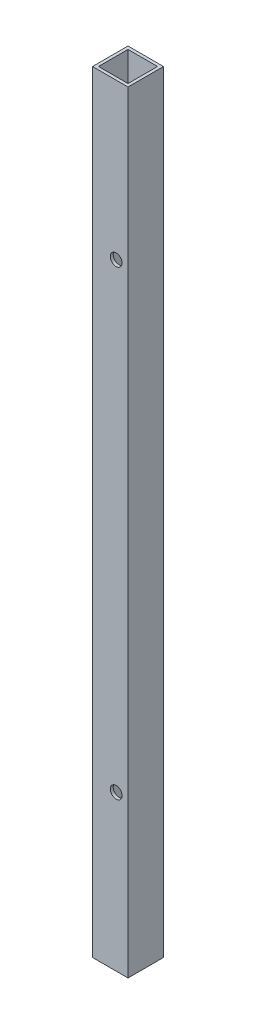
ISO-10303-21;
HEADER;
FILE_DESCRIPTION(('STEP AP214'),'2;1');
FILE_NAME('part.step','',(''),(''),'','','');
FILE_SCHEMA(('AUTOMOTIVE_DESIGN { 1 0 10303 214 1 1 1 1 }'));
ENDSEC;
DATA;
#1=APPLICATION_CONTEXT('core data for automotive mechanical design processes');
#2=APPLICATION_PROTOCOL_DEFINITION('international standard','automotive_design',2000,#1);
#3=PRODUCT_CONTEXT('',#1,'mechanical');
#4=PRODUCT('Part','Part','',(#3));
#5=PRODUCT_RELATED_PRODUCT_CATEGORY('part','',(#4));
#6=PRODUCT_DEFINITION_FORMATION('','',#4);
#7=PRODUCT_DEFINITION_CONTEXT('part definition',#1,'design');
#8=PRODUCT_DEFINITION('design','',#6,#7);
#9=PRODUCT_DEFINITION_SHAPE('','',#8);
#10=(LENGTH_UNIT() NAMED_UNIT(*) SI_UNIT(.MILLI.,.METRE.));
#11=(NAMED_UNIT(*) PLANE_ANGLE_UNIT() SI_UNIT($,.RADIAN.));
#12=(NAMED_UNIT(*) SI_UNIT($,.STERADIAN.) SOLID_ANGLE_UNIT());
#13=UNCERTAINTY_MEASURE_WITH_UNIT(LENGTH_MEASURE(1.E-05),#10,'distance_accuracy_value','');
#14=(GEOMETRIC_REPRESENTATION_CONTEXT(3) GLOBAL_UNCERTAINTY_ASSIGNED_CONTEXT((#13)) GLOBAL_UNIT_ASSIGNED_CONTEXT((#10,
#11,#12)) REPRESENTATION_CONTEXT('',''));
#15=CARTESIAN_POINT('',(0.,0.,0.));
#16=DIRECTION('',(0.,0.,1.));
#17=DIRECTION('',(1.,0.,0.));
#18=AXIS2_PLACEMENT_3D('',#15,#16,#17);
#19=CARTESIAN_POINT('',(0.,414.3375,0.));
#20=DIRECTION('',(0.,-1.,0.));
#21=DIRECTION('',(0.,0.,-1.));
#22=AXIS2_PLACEMENT_3D('',#19,#20,#21);
#23=PLANE('',#22);
#24=DIRECTION('',(0.,0.,1.));
#25=VECTOR('',#24,1.);
#26=CARTESIAN_POINT('',(0.,414.3375,0.));
#27=LINE('',#26,#25);
#28=CARTESIAN_POINT('',(0.,414.3375,-19.05));
#29=VERTEX_POINT('',#28);
#30=CARTESIAN_POINT('',(0.,414.3375,0.));
#31=VERTEX_POINT('',#30);
#32=EDGE_CURVE('E161',#29,#31,#27,.T.);
#33=ORIENTED_EDGE('',*,*,#32,.T.);
#34=DIRECTION('',(1.,0.,0.));
#35=VECTOR('',#34,1.);
#36=CARTESIAN_POINT('',(0.,414.3375,0.));
#37=LINE('',#36,#35);
#38=CARTESIAN_POINT('',(19.05,414.3375,0.));
#39=VERTEX_POINT('',#38);
#40=EDGE_CURVE('E164',#31,#39,#37,.T.);
#41=ORIENTED_EDGE('',*,*,#40,.T.);
#42=DIRECTION('',(0.,0.,-1.));
#43=VECTOR('',#42,1.);
#44=CARTESIAN_POINT('',(19.05,414.3375,0.));
#45=LINE('',#44,#43);
#46=CARTESIAN_POINT('',(19.05,414.3375,-19.05));
#47=VERTEX_POINT('',#46);
#48=EDGE_CURVE('E167',#39,#47,#45,.T.);
#49=ORIENTED_EDGE('',*,*,#48,.T.);
#50=DIRECTION('',(-1.,0.,0.));
#51=VECTOR('',#50,1.);
#52=CARTESIAN_POINT('',(0.,414.3375,-19.05));
#53=LINE('',#52,#51);
#54=EDGE_CURVE('E169',#47,#29,#53,.T.);
#55=ORIENTED_EDGE('',*,*,#54,.T.);
#56=EDGE_LOOP('',(#33,#41,#49,#55));
#57=FACE_BOUND('',#56,.T.);
#58=DIRECTION('',(0.,0.,1.));
#59=VECTOR('',#58,1.);
#60=CARTESIAN_POINT('',(1.5875,414.3375,-1.5875));
#61=LINE('',#60,#59);
#62=CARTESIAN_POINT('',(1.5875,414.3375,-17.4625));
#63=VERTEX_POINT('',#62);
#64=CARTESIAN_POINT('',(1.5875,414.3375,-1.5875));
#65=VERTEX_POINT('',#64);
#66=EDGE_CURVE('E115',#63,#65,#61,.T.);
#67=ORIENTED_EDGE('',*,*,#66,.F.);
#68=DIRECTION('',(-1.,0.,0.));
#69=VECTOR('',#68,1.);
#70=CARTESIAN_POINT('',(1.5875,414.3375,-17.4625));
#71=LINE('',#70,#69);
#72=CARTESIAN_POINT('',(17.4625,414.3375,-17.4625));
#73=VERTEX_POINT('',#72);
#74=EDGE_CURVE('E138',#73,#63,#71,.T.);
#75=ORIENTED_EDGE('',*,*,#74,.F.);
#76=DIRECTION('',(0.,0.,-1.));
#77=VECTOR('',#76,1.);
#78=CARTESIAN_POINT('',(17.4625,414.3375,-1.5875));
#79=LINE('',#78,#77);
#80=CARTESIAN_POINT('',(17.4625,414.3375,-1.5875));
#81=VERTEX_POINT('',#80);
#82=EDGE_CURVE('E136',#81,#73,#79,.T.);
#83=ORIENTED_EDGE('',*,*,#82,.F.);
#84=DIRECTION('',(1.,0.,0.));
#85=VECTOR('',#84,1.);
#86=CARTESIAN_POINT('',(1.5875,414.3375,-1.5875));
#87=LINE('',#86,#85);
#88=EDGE_CURVE('E123',#65,#81,#87,.T.);
#89=ORIENTED_EDGE('',*,*,#88,.F.);
#90=EDGE_LOOP('',(#67,#75,#83,#89));
#91=FACE_BOUND('',#90,.T.);
#92=ADVANCED_FACE('F39',(#57,#91),#23,.F.);
#93=CARTESIAN_POINT('',(0.,0.,0.));
#94=DIRECTION('',(0.,-1.,0.));
#95=DIRECTION('',(0.,0.,-1.));
#96=AXIS2_PLACEMENT_3D('',#93,#94,#95);
#97=PLANE('',#96);
#98=DIRECTION('',(0.,0.,1.));
#99=VECTOR('',#98,1.);
#100=CARTESIAN_POINT('',(0.,0.,0.));
#101=LINE('',#100,#99);
#102=CARTESIAN_POINT('',(0.,0.,-19.05));
#103=VERTEX_POINT('',#102);
#104=CARTESIAN_POINT('',(0.,0.,0.));
#105=VERTEX_POINT('',#104);
#106=EDGE_CURVE('E132',#103,#105,#101,.T.);
#107=ORIENTED_EDGE('',*,*,#106,.F.);
#108=DIRECTION('',(-1.,0.,0.));
#109=VECTOR('',#108,1.);
#110=CARTESIAN_POINT('',(0.,0.,-19.05));
#111=LINE('',#110,#109);
#112=CARTESIAN_POINT('',(19.05,0.,-19.05));
#113=VERTEX_POINT('',#112);
#114=EDGE_CURVE('E165',#113,#103,#111,.T.);
#115=ORIENTED_EDGE('',*,*,#114,.F.);
#116=DIRECTION('',(0.,0.,-1.));
#117=VECTOR('',#116,1.);
#118=CARTESIAN_POINT('',(19.05,0.,0.));
#119=LINE('',#118,#117);
#120=CARTESIAN_POINT('',(19.05,0.,0.));
#121=VERTEX_POINT('',#120);
#122=EDGE_CURVE('E178',#121,#113,#119,.T.);
#123=ORIENTED_EDGE('',*,*,#122,.F.);
#124=DIRECTION('',(1.,0.,0.));
#125=VECTOR('',#124,1.);
#126=CARTESIAN_POINT('',(0.,0.,0.));
#127=LINE('',#126,#125);
#128=EDGE_CURVE('E175',#105,#121,#127,.T.);
#129=ORIENTED_EDGE('',*,*,#128,.F.);
#130=EDGE_LOOP('',(#107,#115,#123,#129));
#131=FACE_BOUND('',#130,.T.);
#132=DIRECTION('',(-1.,0.,0.));
#133=VECTOR('',#132,1.);
#134=CARTESIAN_POINT('',(1.5875,0.,-17.4625));
#135=LINE('',#134,#133);
#136=CARTESIAN_POINT('',(17.4625,0.,-17.4625));
#137=VERTEX_POINT('',#136);
#138=CARTESIAN_POINT('',(1.5875,0.,-17.4625));
#139=VERTEX_POINT('',#138);
#140=EDGE_CURVE('E124',#137,#139,#135,.T.);
#141=ORIENTED_EDGE('',*,*,#140,.T.);
#142=DIRECTION('',(0.,0.,1.));
#143=VECTOR('',#142,1.);
#144=CARTESIAN_POINT('',(1.5875,0.,-1.5875));
#145=LINE('',#144,#143);
#146=CARTESIAN_POINT('',(1.5875,0.,-1.5875));
#147=VERTEX_POINT('',#146);
#148=EDGE_CURVE('E68',#139,#147,#145,.T.);
#149=ORIENTED_EDGE('',*,*,#148,.T.);
#150=DIRECTION('',(1.,0.,0.));
#151=VECTOR('',#150,1.);
#152=CARTESIAN_POINT('',(1.5875,0.,-1.5875));
#153=LINE('',#152,#151);
#154=CARTESIAN_POINT('',(17.4625,0.,-1.5875));
#155=VERTEX_POINT('',#154);
#156=EDGE_CURVE('E130',#147,#155,#153,.T.);
#157=ORIENTED_EDGE('',*,*,#156,.T.);
#158=DIRECTION('',(0.,0.,-1.));
#159=VECTOR('',#158,1.);
#160=CARTESIAN_POINT('',(17.4625,0.,-1.5875));
#161=LINE('',#160,#159);
#162=EDGE_CURVE('E148',#155,#137,#161,.T.);
#163=ORIENTED_EDGE('',*,*,#162,.T.);
#164=EDGE_LOOP('',(#141,#149,#157,#163));
#165=FACE_BOUND('',#164,.T.);
#166=ADVANCED_FACE('F238',(#131,#165),#97,.T.);
#167=CARTESIAN_POINT('',(0.,414.3375,0.));
#168=DIRECTION('',(1.,0.,0.));
#169=DIRECTION('',(0.,0.,-1.));
#170=AXIS2_PLACEMENT_3D('',#167,#168,#169);
#171=PLANE('',#170);
#172=ORIENTED_EDGE('',*,*,#106,.T.);
#173=DIRECTION('',(0.,-1.,0.));
#174=VECTOR('',#173,1.);
#175=CARTESIAN_POINT('',(0.,414.3375,0.));
#176=LINE('',#175,#174);
#177=EDGE_CURVE('E11',#31,#105,#176,.T.);
#178=ORIENTED_EDGE('',*,*,#177,.F.);
#179=ORIENTED_EDGE('',*,*,#32,.F.);
#180=DIRECTION('',(0.,-1.,0.));
#181=VECTOR('',#180,1.);
#182=CARTESIAN_POINT('',(0.,414.3375,-19.05));
#183=LINE('',#182,#181);
#184=EDGE_CURVE('E171',#29,#103,#183,.T.);
#185=ORIENTED_EDGE('',*,*,#184,.T.);
#186=EDGE_LOOP('',(#172,#178,#179,#185));
#187=FACE_BOUND('',#186,.T.);
#188=ADVANCED_FACE('F41',(#187),#171,.F.);
#189=CARTESIAN_POINT('',(0.,414.3375,0.));
#190=DIRECTION('',(0.,0.,-1.));
#191=DIRECTION('',(-1.,0.,0.));
#192=AXIS2_PLACEMENT_3D('',#189,#190,#191);
#193=PLANE('',#192);
#194=CARTESIAN_POINT('',(12.7000000000001,330.82992,0.));
#195=DIRECTION('',(0.,0.,1.));
#196=DIRECTION('',(1.,0.,0.));
#197=AXIS2_PLACEMENT_3D('',#194,#195,#196);
#198=CIRCLE('',#197,3.175);
#199=CARTESIAN_POINT('',(15.8750000000001,330.82992,0.));
#200=VERTEX_POINT('',#199);
#201=EDGE_CURVE('E214',#200,#200,#198,.T.);
#202=ORIENTED_EDGE('',*,*,#201,.F.);
#203=EDGE_LOOP('',(#202));
#204=FACE_BOUND('',#203,.T.);
#205=CARTESIAN_POINT('',(12.7000000000001,83.17992,0.));
#206=DIRECTION('',(0.,0.,1.));
#207=DIRECTION('',(1.,0.,0.));
#208=AXIS2_PLACEMENT_3D('',#205,#206,#207);
#209=CIRCLE('',#208,3.175);
#210=CARTESIAN_POINT('',(15.8750000000001,83.17992,0.));
#211=VERTEX_POINT('',#210);
#212=EDGE_CURVE('E202',#211,#211,#209,.T.);
#213=ORIENTED_EDGE('',*,*,#212,.F.);
#214=EDGE_LOOP('',(#213));
#215=FACE_BOUND('',#214,.T.);
#216=ORIENTED_EDGE('',*,*,#128,.T.);
#217=DIRECTION('',(0.,-1.,0.));
#218=VECTOR('',#217,1.);
#219=CARTESIAN_POINT('',(19.05,414.3375,0.));
#220=LINE('',#219,#218);
#221=EDGE_CURVE('E49',#39,#121,#220,.T.);
#222=ORIENTED_EDGE('',*,*,#221,.F.);
#223=ORIENTED_EDGE('',*,*,#40,.F.);
#224=ORIENTED_EDGE('',*,*,#177,.T.);
#225=EDGE_LOOP('',(#216,#222,#223,#224));
#226=FACE_BOUND('',#225,.T.);
#227=ADVANCED_FACE('F264',(#204,#215,#226),#193,.F.);
#228=CARTESIAN_POINT('',(19.05,414.3375,0.));
#229=DIRECTION('',(-1.,0.,0.));
#230=DIRECTION('',(0.,0.,1.));
#231=AXIS2_PLACEMENT_3D('',#228,#229,#230);
#232=PLANE('',#231);
#233=ORIENTED_EDGE('',*,*,#122,.T.);
#234=DIRECTION('',(0.,-1.,0.));
#235=VECTOR('',#234,1.);
#236=CARTESIAN_POINT('',(19.05,414.3375,-19.05));
#237=LINE('',#236,#235);
#238=EDGE_CURVE('E186',#47,#113,#237,.T.);
#239=ORIENTED_EDGE('',*,*,#238,.F.);
#240=ORIENTED_EDGE('',*,*,#48,.F.);
#241=ORIENTED_EDGE('',*,*,#221,.T.);
#242=EDGE_LOOP('',(#233,#239,#240,#241));
#243=FACE_BOUND('',#242,.T.);
#244=ADVANCED_FACE('F262',(#243),#232,.F.);
#245=CARTESIAN_POINT('',(0.,414.3375,-19.05));
#246=DIRECTION('',(0.,0.,1.));
#247=DIRECTION('',(1.,0.,0.));
#248=AXIS2_PLACEMENT_3D('',#245,#246,#247);
#249=PLANE('',#248);
#250=CARTESIAN_POINT('',(12.7000000000001,330.82992,-19.05));
#251=DIRECTION('',(0.,0.,1.));
#252=DIRECTION('',(1.,0.,0.));
#253=AXIS2_PLACEMENT_3D('',#250,#251,#252);
#254=CIRCLE('',#253,3.175);
#255=CARTESIAN_POINT('',(15.8750000000001,330.82992,-19.05));
#256=VERTEX_POINT('',#255);
#257=EDGE_CURVE('E218',#256,#256,#254,.T.);
#258=ORIENTED_EDGE('',*,*,#257,.T.);
#259=EDGE_LOOP('',(#258));
#260=FACE_BOUND('',#259,.T.);
#261=CARTESIAN_POINT('',(12.7000000000001,83.17992,-19.05));
#262=DIRECTION('',(0.,0.,1.));
#263=DIRECTION('',(1.,0.,0.));
#264=AXIS2_PLACEMENT_3D('',#261,#262,#263);
#265=CIRCLE('',#264,3.175);
#266=CARTESIAN_POINT('',(15.8750000000001,83.17992,-19.05));
#267=VERTEX_POINT('',#266);
#268=EDGE_CURVE('E195',#267,#267,#265,.T.);
#269=ORIENTED_EDGE('',*,*,#268,.T.);
#270=EDGE_LOOP('',(#269));
#271=FACE_BOUND('',#270,.T.);
#272=ORIENTED_EDGE('',*,*,#114,.T.);
#273=ORIENTED_EDGE('',*,*,#184,.F.);
#274=ORIENTED_EDGE('',*,*,#54,.F.);
#275=ORIENTED_EDGE('',*,*,#238,.T.);
#276=EDGE_LOOP('',(#272,#273,#274,#275));
#277=FACE_BOUND('',#276,.T.);
#278=ADVANCED_FACE('F259',(#260,#271,#277),#249,.F.);
#279=CARTESIAN_POINT('',(1.5875,414.3375,-1.5875));
#280=DIRECTION('',(1.,0.,0.));
#281=DIRECTION('',(0.,0.,-1.));
#282=AXIS2_PLACEMENT_3D('',#279,#280,#281);
#283=PLANE('',#282);
#284=ORIENTED_EDGE('',*,*,#148,.F.);
#285=DIRECTION('',(0.,-1.,0.));
#286=VECTOR('',#285,1.);
#287=CARTESIAN_POINT('',(1.5875,414.3375,-17.4625));
#288=LINE('',#287,#286);
#289=EDGE_CURVE('E119',#63,#139,#288,.T.);
#290=ORIENTED_EDGE('',*,*,#289,.F.);
#291=ORIENTED_EDGE('',*,*,#66,.T.);
#292=DIRECTION('',(0.,-1.,0.));
#293=VECTOR('',#292,1.);
#294=CARTESIAN_POINT('',(1.5875,414.3375,-1.5875));
#295=LINE('',#294,#293);
#296=EDGE_CURVE('E118',#65,#147,#295,.T.);
#297=ORIENTED_EDGE('',*,*,#296,.T.);
#298=EDGE_LOOP('',(#284,#290,#291,#297));
#299=FACE_BOUND('',#298,.T.);
#300=ADVANCED_FACE('F117',(#299),#283,.T.);
#301=CARTESIAN_POINT('',(1.5875,414.3375,-1.5875));
#302=DIRECTION('',(0.,0.,-1.));
#303=DIRECTION('',(-1.,0.,0.));
#304=AXIS2_PLACEMENT_3D('',#301,#302,#303);
#305=PLANE('',#304);
#306=CARTESIAN_POINT('',(12.7000000000001,330.82992,-1.5875));
#307=DIRECTION('',(0.,0.,-1.));
#308=DIRECTION('',(-1.,0.,0.));
#309=AXIS2_PLACEMENT_3D('',#306,#307,#308);
#310=CIRCLE('',#309,3.175);
#311=CARTESIAN_POINT('',(9.52500000000006,330.82992,-1.5875));
#312=VERTEX_POINT('',#311);
#313=EDGE_CURVE('E208',#312,#312,#310,.T.);
#314=ORIENTED_EDGE('',*,*,#313,.F.);
#315=EDGE_LOOP('',(#314));
#316=FACE_BOUND('',#315,.T.);
#317=CARTESIAN_POINT('',(12.7000000000001,83.17992,-1.5875));
#318=DIRECTION('',(0.,0.,-1.));
#319=DIRECTION('',(-1.,0.,0.));
#320=AXIS2_PLACEMENT_3D('',#317,#318,#319);
#321=CIRCLE('',#320,3.175);
#322=CARTESIAN_POINT('',(9.52500000000006,83.17992,-1.5875));
#323=VERTEX_POINT('',#322);
#324=EDGE_CURVE('E145',#323,#323,#321,.T.);
#325=ORIENTED_EDGE('',*,*,#324,.F.);
#326=EDGE_LOOP('',(#325));
#327=FACE_BOUND('',#326,.T.);
#328=ORIENTED_EDGE('',*,*,#156,.F.);
#329=ORIENTED_EDGE('',*,*,#296,.F.);
#330=ORIENTED_EDGE('',*,*,#88,.T.);
#331=DIRECTION('',(0.,-1.,0.));
#332=VECTOR('',#331,1.);
#333=CARTESIAN_POINT('',(17.4625,414.3375,-1.5875));
#334=LINE('',#333,#332);
#335=EDGE_CURVE('E133',#81,#155,#334,.T.);
#336=ORIENTED_EDGE('',*,*,#335,.T.);
#337=EDGE_LOOP('',(#328,#329,#330,#336));
#338=FACE_BOUND('',#337,.T.);
#339=ADVANCED_FACE('F127',(#316,#327,#338),#305,.T.);
#340=CARTESIAN_POINT('',(17.4625,414.3375,-1.5875));
#341=DIRECTION('',(-1.,0.,0.));
#342=DIRECTION('',(0.,0.,1.));
#343=AXIS2_PLACEMENT_3D('',#340,#341,#342);
#344=PLANE('',#343);
#345=ORIENTED_EDGE('',*,*,#162,.F.);
#346=ORIENTED_EDGE('',*,*,#335,.F.);
#347=ORIENTED_EDGE('',*,*,#82,.T.);
#348=DIRECTION('',(0.,-1.,0.));
#349=VECTOR('',#348,1.);
#350=CARTESIAN_POINT('',(17.4625,414.3375,-17.4625));
#351=LINE('',#350,#349);
#352=EDGE_CURVE('E57',#73,#137,#351,.T.);
#353=ORIENTED_EDGE('',*,*,#352,.T.);
#354=EDGE_LOOP('',(#345,#346,#347,#353));
#355=FACE_BOUND('',#354,.T.);
#356=ADVANCED_FACE('F234',(#355),#344,.T.);
#357=CARTESIAN_POINT('',(1.5875,414.3375,-17.4625));
#358=DIRECTION('',(0.,0.,1.));
#359=DIRECTION('',(1.,0.,0.));
#360=AXIS2_PLACEMENT_3D('',#357,#358,#359);
#361=PLANE('',#360);
#362=CARTESIAN_POINT('',(12.7000000000001,330.82992,-17.4625));
#363=DIRECTION('',(0.,0.,1.));
#364=DIRECTION('',(1.,0.,0.));
#365=AXIS2_PLACEMENT_3D('',#362,#363,#364);
#366=CIRCLE('',#365,3.175);
#367=CARTESIAN_POINT('',(15.8750000000001,330.82992,-17.4625));
#368=VERTEX_POINT('',#367);
#369=EDGE_CURVE('E43',#368,#368,#366,.T.);
#370=ORIENTED_EDGE('',*,*,#369,.F.);
#371=EDGE_LOOP('',(#370));
#372=FACE_BOUND('',#371,.T.);
#373=CARTESIAN_POINT('',(12.7000000000001,83.17992,-17.4625));
#374=DIRECTION('',(0.,0.,1.));
#375=DIRECTION('',(1.,0.,0.));
#376=AXIS2_PLACEMENT_3D('',#373,#374,#375);
#377=CIRCLE('',#376,3.175);
#378=CARTESIAN_POINT('',(15.8750000000001,83.17992,-17.4625));
#379=VERTEX_POINT('',#378);
#380=EDGE_CURVE('E192',#379,#379,#377,.T.);
#381=ORIENTED_EDGE('',*,*,#380,.F.);
#382=EDGE_LOOP('',(#381));
#383=FACE_BOUND('',#382,.T.);
#384=ORIENTED_EDGE('',*,*,#140,.F.);
#385=ORIENTED_EDGE('',*,*,#352,.F.);
#386=ORIENTED_EDGE('',*,*,#74,.T.);
#387=ORIENTED_EDGE('',*,*,#289,.T.);
#388=EDGE_LOOP('',(#384,#385,#386,#387));
#389=FACE_BOUND('',#388,.T.);
#390=ADVANCED_FACE('F230',(#372,#383,#389),#361,.T.);
#391=CARTESIAN_POINT('',(12.7000000000001,83.17992,-19.05));
#392=DIRECTION('',(0.,0.,1.));
#393=DIRECTION('',(1.,0.,0.));
#394=AXIS2_PLACEMENT_3D('',#391,#392,#393);
#395=CYLINDRICAL_SURFACE('',#394,3.175);
#396=ORIENTED_EDGE('',*,*,#380,.T.);
#397=EDGE_LOOP('',(#396));
#398=FACE_BOUND('',#397,.T.);
#399=ORIENTED_EDGE('',*,*,#268,.F.);
#400=EDGE_LOOP('',(#399));
#401=FACE_BOUND('',#400,.T.);
#402=ADVANCED_FACE('F233',(#398,#401),#395,.F.);
#403=ORIENTED_EDGE('',*,*,#324,.T.);
#404=EDGE_LOOP('',(#403));
#405=FACE_BOUND('',#404,.T.);
#406=ORIENTED_EDGE('',*,*,#212,.T.);
#407=EDGE_LOOP('',(#406));
#408=FACE_BOUND('',#407,.T.);
#409=ADVANCED_FACE('F289',(#405,#408),#395,.F.);
#410=CARTESIAN_POINT('',(12.7000000000001,330.82992,-19.05));
#411=DIRECTION('',(0.,0.,1.));
#412=DIRECTION('',(1.,0.,0.));
#413=AXIS2_PLACEMENT_3D('',#410,#411,#412);
#414=CYLINDRICAL_SURFACE('',#413,3.175);
#415=ORIENTED_EDGE('',*,*,#369,.T.);
#416=EDGE_LOOP('',(#415));
#417=FACE_BOUND('',#416,.T.);
#418=ORIENTED_EDGE('',*,*,#257,.F.);
#419=EDGE_LOOP('',(#418));
#420=FACE_BOUND('',#419,.T.);
#421=ADVANCED_FACE('F227',(#417,#420),#414,.F.);
#422=ORIENTED_EDGE('',*,*,#313,.T.);
#423=EDGE_LOOP('',(#422));
#424=FACE_BOUND('',#423,.T.);
#425=ORIENTED_EDGE('',*,*,#201,.T.);
#426=EDGE_LOOP('',(#425));
#427=FACE_BOUND('',#426,.T.);
#428=ADVANCED_FACE('F297',(#424,#427),#414,.F.);
#429=CLOSED_SHELL('',(#92,#166,#188,#227,#244,#278,#300,#339,#356,#390,#402,#409,#421,#428));
#430=MANIFOLD_SOLID_BREP('B2',#429);
#431=ADVANCED_BREP_SHAPE_REPRESENTATION('',(#18,#430),#14);
#432=SHAPE_DEFINITION_REPRESENTATION(#9,#431);
ENDSEC;
END-ISO-10303-21;
